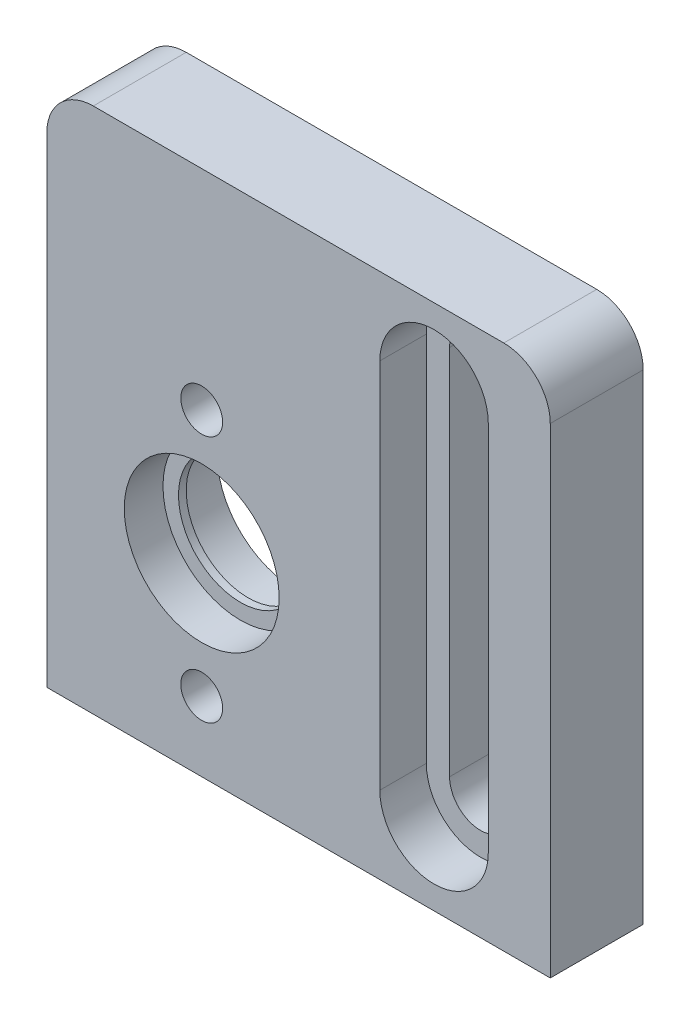
ISO-10303-21;
HEADER;
FILE_DESCRIPTION(('STEP AP214'),'2;1');
FILE_NAME('part.step','',(''),(''),'','','');
FILE_SCHEMA(('AUTOMOTIVE_DESIGN { 1 0 10303 214 1 1 1 1 }'));
ENDSEC;
DATA;
#1=APPLICATION_CONTEXT('core data for automotive mechanical design processes');
#2=APPLICATION_PROTOCOL_DEFINITION('international standard','automotive_design',2000,#1);
#3=PRODUCT_CONTEXT('',#1,'mechanical');
#4=PRODUCT('Part','Part','',(#3));
#5=PRODUCT_RELATED_PRODUCT_CATEGORY('part','',(#4));
#6=PRODUCT_DEFINITION_FORMATION('','',#4);
#7=PRODUCT_DEFINITION_CONTEXT('part definition',#1,'design');
#8=PRODUCT_DEFINITION('design','',#6,#7);
#9=PRODUCT_DEFINITION_SHAPE('','',#8);
#10=(LENGTH_UNIT() NAMED_UNIT(*) SI_UNIT(.MILLI.,.METRE.));
#11=(NAMED_UNIT(*) PLANE_ANGLE_UNIT() SI_UNIT($,.RADIAN.));
#12=(NAMED_UNIT(*) SI_UNIT($,.STERADIAN.) SOLID_ANGLE_UNIT());
#13=UNCERTAINTY_MEASURE_WITH_UNIT(LENGTH_MEASURE(1.E-05),#10,'distance_accuracy_value','');
#14=(GEOMETRIC_REPRESENTATION_CONTEXT(3) GLOBAL_UNCERTAINTY_ASSIGNED_CONTEXT((#13)) GLOBAL_UNIT_ASSIGNED_CONTEXT((#10,
#11,#12)) REPRESENTATION_CONTEXT('',''));
#15=CARTESIAN_POINT('',(0.,0.,0.));
#16=DIRECTION('',(0.,0.,1.));
#17=DIRECTION('',(1.,0.,0.));
#18=AXIS2_PLACEMENT_3D('',#15,#16,#17);
#19=CARTESIAN_POINT('',(0.,0.,9.));
#20=DIRECTION('',(0.,0.,-1.));
#21=DIRECTION('',(1.,0.,0.));
#22=AXIS2_PLACEMENT_3D('',#19,#20,#21);
#23=PLANE('',#22);
#24=CARTESIAN_POINT('',(-22.5,5.,9.));
#25=DIRECTION('',(0.,0.,-1.));
#26=DIRECTION('',(-1.,0.,0.));
#27=AXIS2_PLACEMENT_3D('',#24,#25,#26);
#28=CIRCLE('',#27,1.35);
#29=CARTESIAN_POINT('',(-23.85,5.,9.));
#30=VERTEX_POINT('',#29);
#31=EDGE_CURVE('E454',#30,#30,#28,.T.);
#32=ORIENTED_EDGE('',*,*,#31,.T.);
#33=EDGE_LOOP('',(#32));
#34=FACE_BOUND('',#33,.T.);
#35=CARTESIAN_POINT('',(-22.5,-11.,9.));
#36=DIRECTION('',(0.,0.,-1.));
#37=DIRECTION('',(-1.,0.,0.));
#38=AXIS2_PLACEMENT_3D('',#35,#36,#37);
#39=CIRCLE('',#38,1.35);
#40=CARTESIAN_POINT('',(-23.85,-11.,9.));
#41=VERTEX_POINT('',#40);
#42=EDGE_CURVE('E440',#41,#41,#39,.T.);
#43=ORIENTED_EDGE('',*,*,#42,.T.);
#44=EDGE_LOOP('',(#43));
#45=FACE_BOUND('',#44,.T.);
#46=DIRECTION('',(0.,1.,0.));
#47=VECTOR('',#46,1.);
#48=CARTESIAN_POINT('',(0.,-15.5,9.));
#49=LINE('',#48,#47);
#50=CARTESIAN_POINT('',(0.,-15.5,9.));
#51=VERTEX_POINT('',#50);
#52=CARTESIAN_POINT('',(0.,15.5,9.));
#53=VERTEX_POINT('',#52);
#54=EDGE_CURVE('E196',#51,#53,#49,.T.);
#55=ORIENTED_EDGE('',*,*,#54,.T.);
#56=CARTESIAN_POINT('',(-3.,15.5,9.));
#57=DIRECTION('',(0.,0.,-1.));
#58=DIRECTION('',(-1.,0.,0.));
#59=AXIS2_PLACEMENT_3D('',#56,#57,#58);
#60=CIRCLE('',#59,3.);
#61=CARTESIAN_POINT('',(-3.,18.5,9.));
#62=VERTEX_POINT('',#61);
#63=EDGE_CURVE('E13',#53,#62,#60,.F.);
#64=ORIENTED_EDGE('',*,*,#63,.T.);
#65=DIRECTION('',(1.,0.,0.));
#66=VECTOR('',#65,1.);
#67=CARTESIAN_POINT('',(-32.5,18.5,9.));
#68=LINE('',#67,#66);
#69=CARTESIAN_POINT('',(-29.5,18.5,9.));
#70=VERTEX_POINT('',#69);
#71=EDGE_CURVE('E219',#70,#62,#68,.T.);
#72=ORIENTED_EDGE('',*,*,#71,.F.);
#73=CARTESIAN_POINT('',(-29.5,15.5,9.));
#74=DIRECTION('',(0.,0.,1.));
#75=DIRECTION('',(1.,0.,0.));
#76=AXIS2_PLACEMENT_3D('',#73,#74,#75);
#77=CIRCLE('',#76,3.);
#78=CARTESIAN_POINT('',(-32.5,15.5,9.));
#79=VERTEX_POINT('',#78);
#80=EDGE_CURVE('E245',#79,#70,#77,.F.);
#81=ORIENTED_EDGE('',*,*,#80,.F.);
#82=DIRECTION('',(0.,-1.,0.));
#83=VECTOR('',#82,1.);
#84=CARTESIAN_POINT('',(-32.5,18.5,9.));
#85=LINE('',#84,#83);
#86=CARTESIAN_POINT('',(-32.5,-15.5,9.));
#87=VERTEX_POINT('',#86);
#88=EDGE_CURVE('E217',#79,#87,#85,.T.);
#89=ORIENTED_EDGE('',*,*,#88,.T.);
#90=DIRECTION('',(1.,0.,0.));
#91=VECTOR('',#90,1.);
#92=CARTESIAN_POINT('',(-32.5,-15.5,9.));
#93=LINE('',#92,#91);
#94=EDGE_CURVE('E210',#87,#51,#93,.T.);
#95=ORIENTED_EDGE('',*,*,#94,.T.);
#96=EDGE_LOOP('',(#55,#64,#72,#81,#89,#95));
#97=FACE_BOUND('',#96,.T.);
#98=DIRECTION('',(0.,-1.,0.));
#99=VECTOR('',#98,1.);
#100=CARTESIAN_POINT('',(-4.,13.5,9.));
#101=LINE('',#100,#99);
#102=CARTESIAN_POINT('',(-4.,13.5,9.));
#103=VERTEX_POINT('',#102);
#104=CARTESIAN_POINT('',(-4.,-10.5,9.));
#105=VERTEX_POINT('',#104);
#106=EDGE_CURVE('E408',#103,#105,#101,.T.);
#107=ORIENTED_EDGE('',*,*,#106,.T.);
#108=CARTESIAN_POINT('',(-7.5,-10.5,9.));
#109=DIRECTION('',(0.,0.,-1.));
#110=DIRECTION('',(-1.,0.,0.));
#111=AXIS2_PLACEMENT_3D('',#108,#109,#110);
#112=CIRCLE('',#111,3.5);
#113=CARTESIAN_POINT('',(-11.,-10.5,9.));
#114=VERTEX_POINT('',#113);
#115=EDGE_CURVE('E405',#105,#114,#112,.T.);
#116=ORIENTED_EDGE('',*,*,#115,.T.);
#117=DIRECTION('',(0.,-1.,0.));
#118=VECTOR('',#117,1.);
#119=CARTESIAN_POINT('',(-11.,13.5,9.));
#120=LINE('',#119,#118);
#121=CARTESIAN_POINT('',(-11.,13.5,9.));
#122=VERTEX_POINT('',#121);
#123=EDGE_CURVE('E401',#122,#114,#120,.T.);
#124=ORIENTED_EDGE('',*,*,#123,.F.);
#125=CARTESIAN_POINT('',(-7.5,13.5,9.));
#126=DIRECTION('',(0.,0.,-1.));
#127=DIRECTION('',(-1.,0.,0.));
#128=AXIS2_PLACEMENT_3D('',#125,#126,#127);
#129=CIRCLE('',#128,3.5);
#130=EDGE_CURVE('E411',#122,#103,#129,.T.);
#131=ORIENTED_EDGE('',*,*,#130,.T.);
#132=EDGE_LOOP('',(#107,#116,#124,#131));
#133=FACE_BOUND('',#132,.T.);
#134=CARTESIAN_POINT('',(-22.5,-3.,9.));
#135=DIRECTION('',(0.,0.,-1.));
#136=DIRECTION('',(-1.,0.,0.));
#137=AXIS2_PLACEMENT_3D('',#134,#135,#136);
#138=CIRCLE('',#137,5.);
#139=CARTESIAN_POINT('',(-27.5,-3.,9.));
#140=VERTEX_POINT('',#139);
#141=EDGE_CURVE('E436',#140,#140,#138,.T.);
#142=ORIENTED_EDGE('',*,*,#141,.T.);
#143=EDGE_LOOP('',(#142));
#144=FACE_BOUND('',#143,.T.);
#145=ADVANCED_FACE('F92',(#34,#45,#97,#133,#144),#23,.F.);
#146=CARTESIAN_POINT('',(-7.5,13.5,3.));
#147=DIRECTION('',(0.,0.,1.));
#148=DIRECTION('',(-1.,0.,0.));
#149=AXIS2_PLACEMENT_3D('',#146,#147,#148);
#150=CYLINDRICAL_SURFACE('',#149,2.);
#151=CARTESIAN_POINT('',(-7.5,13.5,6.));
#152=DIRECTION('',(0.,0.,-1.));
#153=DIRECTION('',(-1.,0.,0.));
#154=AXIS2_PLACEMENT_3D('',#151,#152,#153);
#155=CIRCLE('',#154,2.);
#156=CARTESIAN_POINT('',(-5.5,13.5,6.));
#157=VERTEX_POINT('',#156);
#158=CARTESIAN_POINT('',(-9.5,13.5,6.));
#159=VERTEX_POINT('',#158);
#160=EDGE_CURVE('E384',#157,#159,#155,.F.);
#161=ORIENTED_EDGE('',*,*,#160,.T.);
#162=DIRECTION('',(0.,0.,1.));
#163=VECTOR('',#162,1.);
#164=CARTESIAN_POINT('',(-9.5,13.5,3.));
#165=LINE('',#164,#163);
#166=CARTESIAN_POINT('',(-9.5,13.5,3.));
#167=VERTEX_POINT('',#166);
#168=EDGE_CURVE('E360',#167,#159,#165,.T.);
#169=ORIENTED_EDGE('',*,*,#168,.F.);
#170=CARTESIAN_POINT('',(-7.5,13.5,3.));
#171=DIRECTION('',(0.,0.,-1.));
#172=DIRECTION('',(-1.,0.,0.));
#173=AXIS2_PLACEMENT_3D('',#170,#171,#172);
#174=CIRCLE('',#173,2.);
#175=CARTESIAN_POINT('',(-5.5,13.5,3.));
#176=VERTEX_POINT('',#175);
#177=EDGE_CURVE('E381',#167,#176,#174,.T.);
#178=ORIENTED_EDGE('',*,*,#177,.T.);
#179=DIRECTION('',(0.,0.,1.));
#180=VECTOR('',#179,1.);
#181=CARTESIAN_POINT('',(-5.5,13.5,3.));
#182=LINE('',#181,#180);
#183=EDGE_CURVE('E366',#176,#157,#182,.T.);
#184=ORIENTED_EDGE('',*,*,#183,.T.);
#185=EDGE_LOOP('',(#161,#169,#178,#184));
#186=FACE_BOUND('',#185,.T.);
#187=ADVANCED_FACE('F279',(#186),#150,.F.);
#188=CARTESIAN_POINT('',(-9.5,13.5,3.));
#189=DIRECTION('',(1.,0.,0.));
#190=DIRECTION('',(0.,1.,0.));
#191=AXIS2_PLACEMENT_3D('',#188,#189,#190);
#192=PLANE('',#191);
#193=DIRECTION('',(0.,0.,1.));
#194=VECTOR('',#193,1.);
#195=CARTESIAN_POINT('',(-9.5,-10.5,3.));
#196=LINE('',#195,#194);
#197=CARTESIAN_POINT('',(-9.5,-10.5,3.));
#198=VERTEX_POINT('',#197);
#199=CARTESIAN_POINT('',(-9.5,-10.5,6.));
#200=VERTEX_POINT('',#199);
#201=EDGE_CURVE('E363',#198,#200,#196,.T.);
#202=ORIENTED_EDGE('',*,*,#201,.F.);
#203=DIRECTION('',(0.,-1.,0.));
#204=VECTOR('',#203,1.);
#205=CARTESIAN_POINT('',(-9.5,13.5,3.));
#206=LINE('',#205,#204);
#207=EDGE_CURVE('E370',#167,#198,#206,.T.);
#208=ORIENTED_EDGE('',*,*,#207,.F.);
#209=ORIENTED_EDGE('',*,*,#168,.T.);
#210=DIRECTION('',(0.,1.,0.));
#211=VECTOR('',#210,1.);
#212=CARTESIAN_POINT('',(-9.5,13.5,6.));
#213=LINE('',#212,#211);
#214=EDGE_CURVE('E387',#200,#159,#213,.T.);
#215=ORIENTED_EDGE('',*,*,#214,.F.);
#216=EDGE_LOOP('',(#202,#208,#209,#215));
#217=FACE_BOUND('',#216,.T.);
#218=ADVANCED_FACE('F285',(#217),#192,.T.);
#219=CARTESIAN_POINT('',(-7.5,-10.5,3.));
#220=DIRECTION('',(0.,0.,1.));
#221=DIRECTION('',(-1.,0.,0.));
#222=AXIS2_PLACEMENT_3D('',#219,#220,#221);
#223=CYLINDRICAL_SURFACE('',#222,2.);
#224=CARTESIAN_POINT('',(-7.5,-10.5,6.));
#225=DIRECTION('',(0.,0.,-1.));
#226=DIRECTION('',(-1.,0.,0.));
#227=AXIS2_PLACEMENT_3D('',#224,#225,#226);
#228=CIRCLE('',#227,2.);
#229=CARTESIAN_POINT('',(-5.5,-10.5,6.));
#230=VERTEX_POINT('',#229);
#231=EDGE_CURVE('E389',#200,#230,#228,.F.);
#232=ORIENTED_EDGE('',*,*,#231,.T.);
#233=DIRECTION('',(0.,0.,1.));
#234=VECTOR('',#233,1.);
#235=CARTESIAN_POINT('',(-5.5,-10.5,3.));
#236=LINE('',#235,#234);
#237=CARTESIAN_POINT('',(-5.5,-10.5,3.));
#238=VERTEX_POINT('',#237);
#239=EDGE_CURVE('E369',#238,#230,#236,.T.);
#240=ORIENTED_EDGE('',*,*,#239,.F.);
#241=CARTESIAN_POINT('',(-7.5,-10.5,3.));
#242=DIRECTION('',(0.,0.,-1.));
#243=DIRECTION('',(-1.,0.,0.));
#244=AXIS2_PLACEMENT_3D('',#241,#242,#243);
#245=CIRCLE('',#244,2.);
#246=EDGE_CURVE('E377',#238,#198,#245,.T.);
#247=ORIENTED_EDGE('',*,*,#246,.T.);
#248=ORIENTED_EDGE('',*,*,#201,.T.);
#249=EDGE_LOOP('',(#232,#240,#247,#248));
#250=FACE_BOUND('',#249,.T.);
#251=ADVANCED_FACE('F334',(#250),#223,.F.);
#252=CARTESIAN_POINT('',(-5.5,13.5,3.));
#253=DIRECTION('',(1.,0.,0.));
#254=DIRECTION('',(0.,1.,0.));
#255=AXIS2_PLACEMENT_3D('',#252,#253,#254);
#256=PLANE('',#255);
#257=DIRECTION('',(0.,1.,0.));
#258=VECTOR('',#257,1.);
#259=CARTESIAN_POINT('',(-5.5,13.5,6.));
#260=LINE('',#259,#258);
#261=EDGE_CURVE('E235',#230,#157,#260,.T.);
#262=ORIENTED_EDGE('',*,*,#261,.T.);
#263=ORIENTED_EDGE('',*,*,#183,.F.);
#264=DIRECTION('',(0.,-1.,0.));
#265=VECTOR('',#264,1.);
#266=CARTESIAN_POINT('',(-5.5,13.5,3.));
#267=LINE('',#266,#265);
#268=EDGE_CURVE('E379',#176,#238,#267,.T.);
#269=ORIENTED_EDGE('',*,*,#268,.T.);
#270=ORIENTED_EDGE('',*,*,#239,.T.);
#271=EDGE_LOOP('',(#262,#263,#269,#270));
#272=FACE_BOUND('',#271,.T.);
#273=ADVANCED_FACE('F338',(#272),#256,.F.);
#274=CARTESIAN_POINT('',(-22.5,-3.,9.));
#275=DIRECTION('',(0.,0.,-1.));
#276=DIRECTION('',(1.,0.,0.));
#277=AXIS2_PLACEMENT_3D('',#274,#275,#276);
#278=CYLINDRICAL_SURFACE('',#277,3.99999999999999);
#279=CARTESIAN_POINT('',(-22.5,-3.,6.5));
#280=DIRECTION('',(0.,0.,-1.));
#281=DIRECTION('',(-1.,0.,0.));
#282=AXIS2_PLACEMENT_3D('',#279,#280,#281);
#283=CIRCLE('',#282,3.99999999999999);
#284=CARTESIAN_POINT('',(-26.5,-3.,6.5));
#285=VERTEX_POINT('',#284);
#286=EDGE_CURVE('E96',#285,#285,#283,.F.);
#287=ORIENTED_EDGE('',*,*,#286,.T.);
#288=EDGE_LOOP('',(#287));
#289=FACE_BOUND('',#288,.T.);
#290=CARTESIAN_POINT('',(-22.5,-3.,6.));
#291=DIRECTION('',(0.,0.,1.));
#292=DIRECTION('',(1.,0.,0.));
#293=AXIS2_PLACEMENT_3D('',#290,#291,#292);
#294=CIRCLE('',#293,3.99999999999999);
#295=CARTESIAN_POINT('',(-18.5,-3.,6.));
#296=VERTEX_POINT('',#295);
#297=EDGE_CURVE('E231',#296,#296,#294,.F.);
#298=ORIENTED_EDGE('',*,*,#297,.T.);
#299=EDGE_LOOP('',(#298));
#300=FACE_BOUND('',#299,.T.);
#301=ADVANCED_FACE('F292',(#289,#300),#278,.F.);
#302=CARTESIAN_POINT('',(-32.5,18.5,9.));
#303=DIRECTION('',(-1.,0.,0.));
#304=DIRECTION('',(0.,0.,-1.));
#305=AXIS2_PLACEMENT_3D('',#302,#303,#304);
#306=PLANE('',#305);
#307=DIRECTION('',(0.,-1.,0.));
#308=VECTOR('',#307,1.);
#309=CARTESIAN_POINT('',(-32.5,18.5,3.));
#310=LINE('',#309,#308);
#311=CARTESIAN_POINT('',(-32.5,15.5,3.));
#312=VERTEX_POINT('',#311);
#313=CARTESIAN_POINT('',(-32.5,-15.5,3.));
#314=VERTEX_POINT('',#313);
#315=EDGE_CURVE('E228',#312,#314,#310,.T.);
#316=ORIENTED_EDGE('',*,*,#315,.T.);
#317=DIRECTION('',(0.,0.,-1.));
#318=VECTOR('',#317,1.);
#319=CARTESIAN_POINT('',(-32.5,-15.5,9.));
#320=LINE('',#319,#318);
#321=EDGE_CURVE('E222',#87,#314,#320,.T.);
#322=ORIENTED_EDGE('',*,*,#321,.F.);
#323=ORIENTED_EDGE('',*,*,#88,.F.);
#324=DIRECTION('',(0.,0.,-1.));
#325=VECTOR('',#324,1.);
#326=CARTESIAN_POINT('',(-32.5,15.5,9.));
#327=LINE('',#326,#325);
#328=EDGE_CURVE('E247',#312,#79,#327,.F.);
#329=ORIENTED_EDGE('',*,*,#328,.F.);
#330=EDGE_LOOP('',(#316,#322,#323,#329));
#331=FACE_BOUND('',#330,.T.);
#332=ADVANCED_FACE('F300',(#331),#306,.T.);
#333=CARTESIAN_POINT('',(-32.5,18.5,9.));
#334=DIRECTION('',(0.,-1.,0.));
#335=DIRECTION('',(0.,0.,1.));
#336=AXIS2_PLACEMENT_3D('',#333,#334,#335);
#337=PLANE('',#336);
#338=ORIENTED_EDGE('',*,*,#71,.T.);
#339=DIRECTION('',(0.,0.,-1.));
#340=VECTOR('',#339,1.);
#341=CARTESIAN_POINT('',(-3.,18.5,9.));
#342=LINE('',#341,#340);
#343=CARTESIAN_POINT('',(-3.,18.5,3.));
#344=VERTEX_POINT('',#343);
#345=EDGE_CURVE('E250',#62,#344,#342,.T.);
#346=ORIENTED_EDGE('',*,*,#345,.T.);
#347=DIRECTION('',(1.,0.,0.));
#348=VECTOR('',#347,1.);
#349=CARTESIAN_POINT('',(-32.5,18.5,3.));
#350=LINE('',#349,#348);
#351=CARTESIAN_POINT('',(-29.5,18.5,3.));
#352=VERTEX_POINT('',#351);
#353=EDGE_CURVE('E224',#352,#344,#350,.T.);
#354=ORIENTED_EDGE('',*,*,#353,.F.);
#355=DIRECTION('',(0.,0.,-1.));
#356=VECTOR('',#355,1.);
#357=CARTESIAN_POINT('',(-29.5,18.5,3.));
#358=LINE('',#357,#356);
#359=EDGE_CURVE('E242',#70,#352,#358,.T.);
#360=ORIENTED_EDGE('',*,*,#359,.F.);
#361=EDGE_LOOP('',(#338,#346,#354,#360));
#362=FACE_BOUND('',#361,.T.);
#363=ADVANCED_FACE('F257',(#362),#337,.F.);
#364=CARTESIAN_POINT('',(-32.5,-15.5,9.));
#365=DIRECTION('',(0.,-1.,0.));
#366=DIRECTION('',(0.,0.,1.));
#367=AXIS2_PLACEMENT_3D('',#364,#365,#366);
#368=PLANE('',#367);
#369=DIRECTION('',(0.,0.,-1.));
#370=VECTOR('',#369,1.);
#371=CARTESIAN_POINT('',(0.,-15.5,9.));
#372=LINE('',#371,#370);
#373=CARTESIAN_POINT('',(0.,-15.5,3.));
#374=VERTEX_POINT('',#373);
#375=EDGE_CURVE('E199',#51,#374,#372,.T.);
#376=ORIENTED_EDGE('',*,*,#375,.F.);
#377=ORIENTED_EDGE('',*,*,#94,.F.);
#378=ORIENTED_EDGE('',*,*,#321,.T.);
#379=DIRECTION('',(1.,0.,0.));
#380=VECTOR('',#379,1.);
#381=CARTESIAN_POINT('',(-32.5,-15.5,3.));
#382=LINE('',#381,#380);
#383=EDGE_CURVE('E212',#314,#374,#382,.T.);
#384=ORIENTED_EDGE('',*,*,#383,.T.);
#385=EDGE_LOOP('',(#376,#377,#378,#384));
#386=FACE_BOUND('',#385,.T.);
#387=CARTESIAN_POINT('',(-28.5,-15.5,5.5));
#388=DIRECTION('',(0.,1.,0.));
#389=DIRECTION('',(0.,0.,1.));
#390=AXIS2_PLACEMENT_3D('',#387,#388,#389);
#391=CIRCLE('',#390,1.25);
#392=CARTESIAN_POINT('',(-28.5,-15.5,6.75));
#393=VERTEX_POINT('',#392);
#394=EDGE_CURVE('E213',#393,#393,#391,.T.);
#395=ORIENTED_EDGE('',*,*,#394,.T.);
#396=EDGE_LOOP('',(#395));
#397=FACE_BOUND('',#396,.T.);
#398=CARTESIAN_POINT('',(-16.5,-15.5,5.5));
#399=DIRECTION('',(0.,1.,0.));
#400=DIRECTION('',(0.,0.,1.));
#401=AXIS2_PLACEMENT_3D('',#398,#399,#400);
#402=CIRCLE('',#401,1.25);
#403=CARTESIAN_POINT('',(-16.5,-15.5,6.75));
#404=VERTEX_POINT('',#403);
#405=EDGE_CURVE('E427',#404,#404,#402,.T.);
#406=ORIENTED_EDGE('',*,*,#405,.T.);
#407=EDGE_LOOP('',(#406));
#408=FACE_BOUND('',#407,.T.);
#409=ADVANCED_FACE('F207',(#386,#397,#408),#368,.T.);
#410=CARTESIAN_POINT('',(0.,0.,3.));
#411=DIRECTION('',(0.,0.,-1.));
#412=DIRECTION('',(1.,0.,0.));
#413=AXIS2_PLACEMENT_3D('',#410,#411,#412);
#414=PLANE('',#413);
#415=CARTESIAN_POINT('',(-22.5,5.,3.));
#416=DIRECTION('',(0.,0.,-1.));
#417=DIRECTION('',(-1.,0.,0.));
#418=AXIS2_PLACEMENT_3D('',#415,#416,#417);
#419=CIRCLE('',#418,2.75);
#420=CARTESIAN_POINT('',(-25.25,5.,3.));
#421=VERTEX_POINT('',#420);
#422=EDGE_CURVE('E462',#421,#421,#419,.T.);
#423=ORIENTED_EDGE('',*,*,#422,.F.);
#424=EDGE_LOOP('',(#423));
#425=FACE_BOUND('',#424,.T.);
#426=CARTESIAN_POINT('',(-22.5,-11.,3.));
#427=DIRECTION('',(0.,0.,-1.));
#428=DIRECTION('',(-1.,0.,0.));
#429=AXIS2_PLACEMENT_3D('',#426,#427,#428);
#430=CIRCLE('',#429,2.75);
#431=CARTESIAN_POINT('',(-25.25,-11.,3.));
#432=VERTEX_POINT('',#431);
#433=EDGE_CURVE('E451',#432,#432,#430,.T.);
#434=ORIENTED_EDGE('',*,*,#433,.F.);
#435=EDGE_LOOP('',(#434));
#436=FACE_BOUND('',#435,.T.);
#437=ORIENTED_EDGE('',*,*,#353,.T.);
#438=CARTESIAN_POINT('',(-3.,15.5,3.));
#439=DIRECTION('',(0.,0.,-1.));
#440=DIRECTION('',(-1.,0.,0.));
#441=AXIS2_PLACEMENT_3D('',#438,#439,#440);
#442=CIRCLE('',#441,3.);
#443=CARTESIAN_POINT('',(0.,15.5,3.));
#444=VERTEX_POINT('',#443);
#445=EDGE_CURVE('E115',#344,#444,#442,.T.);
#446=ORIENTED_EDGE('',*,*,#445,.T.);
#447=DIRECTION('',(0.,1.,0.));
#448=VECTOR('',#447,1.);
#449=CARTESIAN_POINT('',(0.,-15.5,3.));
#450=LINE('',#449,#448);
#451=EDGE_CURVE('E203',#374,#444,#450,.T.);
#452=ORIENTED_EDGE('',*,*,#451,.F.);
#453=ORIENTED_EDGE('',*,*,#383,.F.);
#454=ORIENTED_EDGE('',*,*,#315,.F.);
#455=CARTESIAN_POINT('',(-29.5,15.5,3.));
#456=DIRECTION('',(0.,0.,1.));
#457=DIRECTION('',(1.,0.,0.));
#458=AXIS2_PLACEMENT_3D('',#455,#456,#457);
#459=CIRCLE('',#458,3.);
#460=EDGE_CURVE('E240',#352,#312,#459,.T.);
#461=ORIENTED_EDGE('',*,*,#460,.F.);
#462=EDGE_LOOP('',(#437,#446,#452,#453,#454,#461));
#463=FACE_BOUND('',#462,.T.);
#464=ORIENTED_EDGE('',*,*,#177,.F.);
#465=ORIENTED_EDGE('',*,*,#207,.T.);
#466=ORIENTED_EDGE('',*,*,#246,.F.);
#467=ORIENTED_EDGE('',*,*,#268,.F.);
#468=EDGE_LOOP('',(#464,#465,#466,#467));
#469=FACE_BOUND('',#468,.T.);
#470=CARTESIAN_POINT('',(-22.5,-3.,3.));
#471=DIRECTION('',(0.,0.,1.));
#472=DIRECTION('',(1.,0.,0.));
#473=AXIS2_PLACEMENT_3D('',#470,#471,#472);
#474=CIRCLE('',#473,5.);
#475=CARTESIAN_POINT('',(-17.5,-3.,3.));
#476=VERTEX_POINT('',#475);
#477=EDGE_CURVE('E358',#476,#476,#474,.T.);
#478=ORIENTED_EDGE('',*,*,#477,.T.);
#479=EDGE_LOOP('',(#478));
#480=FACE_BOUND('',#479,.T.);
#481=ADVANCED_FACE('F261',(#425,#436,#463,#469,#480),#414,.T.);
#482=CARTESIAN_POINT('',(-22.5,-3.,6.));
#483=DIRECTION('',(0.,0.,-1.));
#484=DIRECTION('',(1.,0.,0.));
#485=AXIS2_PLACEMENT_3D('',#482,#483,#484);
#486=PLANE('',#485);
#487=CARTESIAN_POINT('',(-22.5,-3.,6.));
#488=DIRECTION('',(0.,0.,1.));
#489=DIRECTION('',(1.,0.,0.));
#490=AXIS2_PLACEMENT_3D('',#487,#488,#489);
#491=CIRCLE('',#490,5.);
#492=CARTESIAN_POINT('',(-17.5,-3.,6.));
#493=VERTEX_POINT('',#492);
#494=EDGE_CURVE('E238',#493,#493,#491,.T.);
#495=ORIENTED_EDGE('',*,*,#494,.F.);
#496=EDGE_LOOP('',(#495));
#497=FACE_BOUND('',#496,.T.);
#498=ORIENTED_EDGE('',*,*,#297,.F.);
#499=EDGE_LOOP('',(#498));
#500=FACE_BOUND('',#499,.T.);
#501=ADVANCED_FACE('F296',(#497,#500),#486,.T.);
#502=CARTESIAN_POINT('',(-22.5,-3.,6.));
#503=DIRECTION('',(0.,0.,-1.));
#504=DIRECTION('',(1.,0.,0.));
#505=AXIS2_PLACEMENT_3D('',#502,#503,#504);
#506=CYLINDRICAL_SURFACE('',#505,5.);
#507=ORIENTED_EDGE('',*,*,#494,.T.);
#508=EDGE_LOOP('',(#507));
#509=FACE_BOUND('',#508,.T.);
#510=ORIENTED_EDGE('',*,*,#477,.F.);
#511=EDGE_LOOP('',(#510));
#512=FACE_BOUND('',#511,.T.);
#513=ADVANCED_FACE('F344',(#509,#512),#506,.F.);
#514=CARTESIAN_POINT('',(-7.5,13.5,6.));
#515=DIRECTION('',(0.,0.,1.));
#516=DIRECTION('',(-1.,0.,0.));
#517=AXIS2_PLACEMENT_3D('',#514,#515,#516);
#518=PLANE('',#517);
#519=CARTESIAN_POINT('',(-7.5,13.5,6.));
#520=DIRECTION('',(0.,0.,-1.));
#521=DIRECTION('',(-1.,0.,0.));
#522=AXIS2_PLACEMENT_3D('',#519,#520,#521);
#523=CIRCLE('',#522,3.5);
#524=CARTESIAN_POINT('',(-11.,13.5,6.));
#525=VERTEX_POINT('',#524);
#526=CARTESIAN_POINT('',(-4.,13.5,6.));
#527=VERTEX_POINT('',#526);
#528=EDGE_CURVE('E404',#525,#527,#523,.T.);
#529=ORIENTED_EDGE('',*,*,#528,.F.);
#530=DIRECTION('',(0.,-1.,0.));
#531=VECTOR('',#530,1.);
#532=CARTESIAN_POINT('',(-11.,13.5,6.));
#533=LINE('',#532,#531);
#534=CARTESIAN_POINT('',(-11.,-10.5,6.));
#535=VERTEX_POINT('',#534);
#536=EDGE_CURVE('E396',#525,#535,#533,.T.);
#537=ORIENTED_EDGE('',*,*,#536,.T.);
#538=CARTESIAN_POINT('',(-7.5,-10.5,6.));
#539=DIRECTION('',(0.,0.,-1.));
#540=DIRECTION('',(-1.,0.,0.));
#541=AXIS2_PLACEMENT_3D('',#538,#539,#540);
#542=CIRCLE('',#541,3.5);
#543=CARTESIAN_POINT('',(-4.,-10.5,6.));
#544=VERTEX_POINT('',#543);
#545=EDGE_CURVE('E417',#544,#535,#542,.T.);
#546=ORIENTED_EDGE('',*,*,#545,.F.);
#547=DIRECTION('',(0.,-1.,0.));
#548=VECTOR('',#547,1.);
#549=CARTESIAN_POINT('',(-4.,13.5,6.));
#550=LINE('',#549,#548);
#551=EDGE_CURVE('E420',#527,#544,#550,.T.);
#552=ORIENTED_EDGE('',*,*,#551,.F.);
#553=EDGE_LOOP('',(#529,#537,#546,#552));
#554=FACE_BOUND('',#553,.T.);
#555=ORIENTED_EDGE('',*,*,#160,.F.);
#556=ORIENTED_EDGE('',*,*,#261,.F.);
#557=ORIENTED_EDGE('',*,*,#231,.F.);
#558=ORIENTED_EDGE('',*,*,#214,.T.);
#559=EDGE_LOOP('',(#555,#556,#557,#558));
#560=FACE_BOUND('',#559,.T.);
#561=ADVANCED_FACE('F330',(#554,#560),#518,.T.);
#562=CARTESIAN_POINT('',(-7.5,13.5,6.));
#563=DIRECTION('',(0.,0.,1.));
#564=DIRECTION('',(-1.,0.,0.));
#565=AXIS2_PLACEMENT_3D('',#562,#563,#564);
#566=CYLINDRICAL_SURFACE('',#565,3.5);
#567=ORIENTED_EDGE('',*,*,#130,.F.);
#568=DIRECTION('',(0.,0.,1.));
#569=VECTOR('',#568,1.);
#570=CARTESIAN_POINT('',(-11.,13.5,6.));
#571=LINE('',#570,#569);
#572=EDGE_CURVE('E392',#525,#122,#571,.T.);
#573=ORIENTED_EDGE('',*,*,#572,.F.);
#574=ORIENTED_EDGE('',*,*,#528,.T.);
#575=DIRECTION('',(0.,0.,1.));
#576=VECTOR('',#575,1.);
#577=CARTESIAN_POINT('',(-4.,13.5,6.));
#578=LINE('',#577,#576);
#579=EDGE_CURVE('E393',#527,#103,#578,.T.);
#580=ORIENTED_EDGE('',*,*,#579,.T.);
#581=EDGE_LOOP('',(#567,#573,#574,#580));
#582=FACE_BOUND('',#581,.T.);
#583=ADVANCED_FACE('F327',(#582),#566,.F.);
#584=CARTESIAN_POINT('',(-11.,13.5,6.));
#585=DIRECTION('',(1.,0.,0.));
#586=DIRECTION('',(0.,1.,0.));
#587=AXIS2_PLACEMENT_3D('',#584,#585,#586);
#588=PLANE('',#587);
#589=ORIENTED_EDGE('',*,*,#123,.T.);
#590=DIRECTION('',(0.,0.,1.));
#591=VECTOR('',#590,1.);
#592=CARTESIAN_POINT('',(-11.,-10.5,6.));
#593=LINE('',#592,#591);
#594=EDGE_CURVE('E398',#535,#114,#593,.T.);
#595=ORIENTED_EDGE('',*,*,#594,.F.);
#596=ORIENTED_EDGE('',*,*,#536,.F.);
#597=ORIENTED_EDGE('',*,*,#572,.T.);
#598=EDGE_LOOP('',(#589,#595,#596,#597));
#599=FACE_BOUND('',#598,.T.);
#600=ADVANCED_FACE('F321',(#599),#588,.T.);
#601=CARTESIAN_POINT('',(-7.5,-10.5,6.));
#602=DIRECTION('',(0.,0.,1.));
#603=DIRECTION('',(-1.,0.,0.));
#604=AXIS2_PLACEMENT_3D('',#601,#602,#603);
#605=CYLINDRICAL_SURFACE('',#604,3.5);
#606=ORIENTED_EDGE('',*,*,#115,.F.);
#607=DIRECTION('',(0.,0.,1.));
#608=VECTOR('',#607,1.);
#609=CARTESIAN_POINT('',(-4.,-10.5,6.));
#610=LINE('',#609,#608);
#611=EDGE_CURVE('E395',#544,#105,#610,.T.);
#612=ORIENTED_EDGE('',*,*,#611,.F.);
#613=ORIENTED_EDGE('',*,*,#545,.T.);
#614=ORIENTED_EDGE('',*,*,#594,.T.);
#615=EDGE_LOOP('',(#606,#612,#613,#614));
#616=FACE_BOUND('',#615,.T.);
#617=ADVANCED_FACE('F315',(#616),#605,.F.);
#618=CARTESIAN_POINT('',(-4.,13.5,6.));
#619=DIRECTION('',(1.,0.,0.));
#620=DIRECTION('',(0.,1.,0.));
#621=AXIS2_PLACEMENT_3D('',#618,#619,#620);
#622=PLANE('',#621);
#623=ORIENTED_EDGE('',*,*,#106,.F.);
#624=ORIENTED_EDGE('',*,*,#579,.F.);
#625=ORIENTED_EDGE('',*,*,#551,.T.);
#626=ORIENTED_EDGE('',*,*,#611,.T.);
#627=EDGE_LOOP('',(#623,#624,#625,#626));
#628=FACE_BOUND('',#627,.T.);
#629=ADVANCED_FACE('F307',(#628),#622,.F.);
#630=CARTESIAN_POINT('',(-29.5,15.5,9.));
#631=DIRECTION('',(0.,0.,1.));
#632=DIRECTION('',(-1.,0.,0.));
#633=AXIS2_PLACEMENT_3D('',#630,#631,#632);
#634=CYLINDRICAL_SURFACE('',#633,3.);
#635=ORIENTED_EDGE('',*,*,#80,.T.);
#636=ORIENTED_EDGE('',*,*,#359,.T.);
#637=ORIENTED_EDGE('',*,*,#460,.T.);
#638=ORIENTED_EDGE('',*,*,#328,.T.);
#639=EDGE_LOOP('',(#635,#636,#637,#638));
#640=FACE_BOUND('',#639,.T.);
#641=ADVANCED_FACE('F266',(#640),#634,.T.);
#642=CARTESIAN_POINT('',(-16.5,-8.5,5.5));
#643=DIRECTION('',(0.,-1.,0.));
#644=DIRECTION('',(0.,0.,1.));
#645=AXIS2_PLACEMENT_3D('',#642,#643,#644);
#646=CONICAL_SURFACE('',#645,1.25,1.02974425867665);
#647=CARTESIAN_POINT('',(-16.5,-7.74892422621555,5.5));
#648=VERTEX_POINT('',#647);
#649=VERTEX_LOOP('',#648);
#650=FACE_BOUND('',#649,.T.);
#651=CARTESIAN_POINT('',(-16.5,-8.5,5.5));
#652=DIRECTION('',(0.,1.,0.));
#653=DIRECTION('',(0.,0.,1.));
#654=AXIS2_PLACEMENT_3D('',#651,#652,#653);
#655=CIRCLE('',#654,1.25);
#656=CARTESIAN_POINT('',(-16.5,-8.5,6.75));
#657=VERTEX_POINT('',#656);
#658=EDGE_CURVE('E414',#657,#657,#655,.T.);
#659=ORIENTED_EDGE('',*,*,#658,.F.);
#660=EDGE_LOOP('',(#659));
#661=FACE_BOUND('',#660,.T.);
#662=ADVANCED_FACE('F306',(#650,#661),#646,.F.);
#663=CARTESIAN_POINT('',(-16.5,-15.5,5.5));
#664=DIRECTION('',(0.,-1.,0.));
#665=DIRECTION('',(0.,0.,1.));
#666=AXIS2_PLACEMENT_3D('',#663,#664,#665);
#667=CYLINDRICAL_SURFACE('',#666,1.25);
#668=ORIENTED_EDGE('',*,*,#658,.T.);
#669=EDGE_LOOP('',(#668));
#670=FACE_BOUND('',#669,.T.);
#671=ORIENTED_EDGE('',*,*,#405,.F.);
#672=EDGE_LOOP('',(#671));
#673=FACE_BOUND('',#672,.T.);
#674=ADVANCED_FACE('F312',(#670,#673),#667,.F.);
#675=CARTESIAN_POINT('',(-28.5,-8.5,5.5));
#676=DIRECTION('',(0.,-1.,0.));
#677=DIRECTION('',(0.,0.,1.));
#678=AXIS2_PLACEMENT_3D('',#675,#676,#677);
#679=CONICAL_SURFACE('',#678,1.25,1.02974425867665);
#680=CARTESIAN_POINT('',(-28.5,-7.74892422621555,5.5));
#681=VERTEX_POINT('',#680);
#682=VERTEX_LOOP('',#681);
#683=FACE_BOUND('',#682,.T.);
#684=CARTESIAN_POINT('',(-28.5,-8.5,5.5));
#685=DIRECTION('',(0.,1.,0.));
#686=DIRECTION('',(0.,0.,1.));
#687=AXIS2_PLACEMENT_3D('',#684,#685,#686);
#688=CIRCLE('',#687,1.25);
#689=CARTESIAN_POINT('',(-28.5,-8.5,6.75));
#690=VERTEX_POINT('',#689);
#691=EDGE_CURVE('E430',#690,#690,#688,.T.);
#692=ORIENTED_EDGE('',*,*,#691,.F.);
#693=EDGE_LOOP('',(#692));
#694=FACE_BOUND('',#693,.T.);
#695=ADVANCED_FACE('F497',(#683,#694),#679,.F.);
#696=CARTESIAN_POINT('',(-28.5,-15.5,5.5));
#697=DIRECTION('',(0.,-1.,0.));
#698=DIRECTION('',(0.,0.,1.));
#699=AXIS2_PLACEMENT_3D('',#696,#697,#698);
#700=CYLINDRICAL_SURFACE('',#699,1.25);
#701=ORIENTED_EDGE('',*,*,#691,.T.);
#702=EDGE_LOOP('',(#701));
#703=FACE_BOUND('',#702,.T.);
#704=ORIENTED_EDGE('',*,*,#394,.F.);
#705=EDGE_LOOP('',(#704));
#706=FACE_BOUND('',#705,.T.);
#707=ADVANCED_FACE('F276',(#703,#706),#700,.F.);
#708=CARTESIAN_POINT('',(0.,-15.5,9.));
#709=DIRECTION('',(-1.,0.,0.));
#710=DIRECTION('',(0.,0.,1.));
#711=AXIS2_PLACEMENT_3D('',#708,#709,#710);
#712=PLANE('',#711);
#713=ORIENTED_EDGE('',*,*,#451,.T.);
#714=DIRECTION('',(0.,0.,-1.));
#715=VECTOR('',#714,1.);
#716=CARTESIAN_POINT('',(0.,15.5,9.));
#717=LINE('',#716,#715);
#718=EDGE_CURVE('E101',#444,#53,#717,.F.);
#719=ORIENTED_EDGE('',*,*,#718,.T.);
#720=ORIENTED_EDGE('',*,*,#54,.F.);
#721=ORIENTED_EDGE('',*,*,#375,.T.);
#722=EDGE_LOOP('',(#713,#719,#720,#721));
#723=FACE_BOUND('',#722,.T.);
#724=ADVANCED_FACE('F198',(#723),#712,.F.);
#725=CARTESIAN_POINT('',(-3.,15.5,9.));
#726=DIRECTION('',(0.,0.,-1.));
#727=DIRECTION('',(-1.,0.,0.));
#728=AXIS2_PLACEMENT_3D('',#725,#726,#727);
#729=CYLINDRICAL_SURFACE('',#728,3.);
#730=ORIENTED_EDGE('',*,*,#63,.F.);
#731=ORIENTED_EDGE('',*,*,#718,.F.);
#732=ORIENTED_EDGE('',*,*,#445,.F.);
#733=ORIENTED_EDGE('',*,*,#345,.F.);
#734=EDGE_LOOP('',(#730,#731,#732,#733));
#735=FACE_BOUND('',#734,.T.);
#736=ADVANCED_FACE('F94',(#735),#729,.T.);
#737=CARTESIAN_POINT('',(-22.5,-3.,6.5));
#738=DIRECTION('',(0.,0.,-1.));
#739=DIRECTION('',(-1.,0.,0.));
#740=AXIS2_PLACEMENT_3D('',#737,#738,#739);
#741=PLANE('',#740);
#742=CARTESIAN_POINT('',(-22.5,-3.,6.5));
#743=DIRECTION('',(0.,0.,-1.));
#744=DIRECTION('',(-1.,0.,0.));
#745=AXIS2_PLACEMENT_3D('',#742,#743,#744);
#746=CIRCLE('',#745,5.);
#747=CARTESIAN_POINT('',(-27.5,-3.,6.5));
#748=VERTEX_POINT('',#747);
#749=EDGE_CURVE('E439',#748,#748,#746,.T.);
#750=ORIENTED_EDGE('',*,*,#749,.F.);
#751=EDGE_LOOP('',(#750));
#752=FACE_BOUND('',#751,.T.);
#753=ORIENTED_EDGE('',*,*,#286,.F.);
#754=EDGE_LOOP('',(#753));
#755=FACE_BOUND('',#754,.T.);
#756=ADVANCED_FACE('F268',(#752,#755),#741,.F.);
#757=CARTESIAN_POINT('',(-22.5,-3.,6.5));
#758=DIRECTION('',(0.,0.,1.));
#759=DIRECTION('',(1.,0.,0.));
#760=AXIS2_PLACEMENT_3D('',#757,#758,#759);
#761=CYLINDRICAL_SURFACE('',#760,5.);
#762=ORIENTED_EDGE('',*,*,#749,.T.);
#763=EDGE_LOOP('',(#762));
#764=FACE_BOUND('',#763,.T.);
#765=ORIENTED_EDGE('',*,*,#141,.F.);
#766=EDGE_LOOP('',(#765));
#767=FACE_BOUND('',#766,.T.);
#768=ADVANCED_FACE('F273',(#764,#767),#761,.F.);
#769=CARTESIAN_POINT('',(-22.5,-11.,3.));
#770=DIRECTION('',(0.,0.,-1.));
#771=DIRECTION('',(-1.,0.,0.));
#772=AXIS2_PLACEMENT_3D('',#769,#770,#771);
#773=CYLINDRICAL_SURFACE('',#772,1.35);
#774=ORIENTED_EDGE('',*,*,#42,.F.);
#775=EDGE_LOOP('',(#774));
#776=FACE_BOUND('',#775,.T.);
#777=CARTESIAN_POINT('',(-22.5,-11.,4.8));
#778=DIRECTION('',(0.,0.,-1.));
#779=DIRECTION('',(-1.,0.,0.));
#780=AXIS2_PLACEMENT_3D('',#777,#778,#779);
#781=CIRCLE('',#780,1.35);
#782=CARTESIAN_POINT('',(-23.85,-11.,4.8));
#783=VERTEX_POINT('',#782);
#784=EDGE_CURVE('E445',#783,#783,#781,.T.);
#785=ORIENTED_EDGE('',*,*,#784,.T.);
#786=EDGE_LOOP('',(#785));
#787=FACE_BOUND('',#786,.T.);
#788=ADVANCED_FACE('F483',(#776,#787),#773,.F.);
#789=CARTESIAN_POINT('',(-21.15,-11.,4.8));
#790=DIRECTION('',(0.,0.,1.));
#791=DIRECTION('',(1.,0.,0.));
#792=AXIS2_PLACEMENT_3D('',#789,#790,#791);
#793=PLANE('',#792);
#794=ORIENTED_EDGE('',*,*,#784,.F.);
#795=EDGE_LOOP('',(#794));
#796=FACE_BOUND('',#795,.T.);
#797=CARTESIAN_POINT('',(-22.5,-11.,4.8));
#798=DIRECTION('',(0.,0.,-1.));
#799=DIRECTION('',(-1.,0.,0.));
#800=AXIS2_PLACEMENT_3D('',#797,#798,#799);
#801=CIRCLE('',#800,2.75);
#802=CARTESIAN_POINT('',(-25.25,-11.,4.8));
#803=VERTEX_POINT('',#802);
#804=EDGE_CURVE('E448',#803,#803,#801,.T.);
#805=ORIENTED_EDGE('',*,*,#804,.T.);
#806=EDGE_LOOP('',(#805));
#807=FACE_BOUND('',#806,.T.);
#808=ADVANCED_FACE('F473',(#796,#807),#793,.F.);
#809=CARTESIAN_POINT('',(-22.5,-11.,3.));
#810=DIRECTION('',(0.,0.,-1.));
#811=DIRECTION('',(-1.,0.,0.));
#812=AXIS2_PLACEMENT_3D('',#809,#810,#811);
#813=CYLINDRICAL_SURFACE('',#812,2.75);
#814=ORIENTED_EDGE('',*,*,#804,.F.);
#815=EDGE_LOOP('',(#814));
#816=FACE_BOUND('',#815,.T.);
#817=ORIENTED_EDGE('',*,*,#433,.T.);
#818=EDGE_LOOP('',(#817));
#819=FACE_BOUND('',#818,.T.);
#820=ADVANCED_FACE('F470',(#816,#819),#813,.F.);
#821=CARTESIAN_POINT('',(-22.5,5.,3.));
#822=DIRECTION('',(0.,0.,-1.));
#823=DIRECTION('',(-1.,0.,0.));
#824=AXIS2_PLACEMENT_3D('',#821,#822,#823);
#825=CYLINDRICAL_SURFACE('',#824,1.35);
#826=ORIENTED_EDGE('',*,*,#31,.F.);
#827=EDGE_LOOP('',(#826));
#828=FACE_BOUND('',#827,.T.);
#829=CARTESIAN_POINT('',(-22.5,5.,4.8));
#830=DIRECTION('',(0.,0.,-1.));
#831=DIRECTION('',(-1.,0.,0.));
#832=AXIS2_PLACEMENT_3D('',#829,#830,#831);
#833=CIRCLE('',#832,1.35);
#834=CARTESIAN_POINT('',(-23.85,5.,4.8));
#835=VERTEX_POINT('',#834);
#836=EDGE_CURVE('E456',#835,#835,#833,.T.);
#837=ORIENTED_EDGE('',*,*,#836,.T.);
#838=EDGE_LOOP('',(#837));
#839=FACE_BOUND('',#838,.T.);
#840=ADVANCED_FACE('F472',(#828,#839),#825,.F.);
#841=CARTESIAN_POINT('',(-21.15,5.,4.8));
#842=DIRECTION('',(0.,0.,1.));
#843=DIRECTION('',(1.,0.,0.));
#844=AXIS2_PLACEMENT_3D('',#841,#842,#843);
#845=PLANE('',#844);
#846=ORIENTED_EDGE('',*,*,#836,.F.);
#847=EDGE_LOOP('',(#846));
#848=FACE_BOUND('',#847,.T.);
#849=CARTESIAN_POINT('',(-22.5,5.,4.8));
#850=DIRECTION('',(0.,0.,-1.));
#851=DIRECTION('',(-1.,0.,0.));
#852=AXIS2_PLACEMENT_3D('',#849,#850,#851);
#853=CIRCLE('',#852,2.75);
#854=CARTESIAN_POINT('',(-25.25,5.,4.8));
#855=VERTEX_POINT('',#854);
#856=EDGE_CURVE('E459',#855,#855,#853,.T.);
#857=ORIENTED_EDGE('',*,*,#856,.T.);
#858=EDGE_LOOP('',(#857));
#859=FACE_BOUND('',#858,.T.);
#860=ADVANCED_FACE('F480',(#848,#859),#845,.F.);
#861=CARTESIAN_POINT('',(-22.5,5.,3.));
#862=DIRECTION('',(0.,0.,-1.));
#863=DIRECTION('',(-1.,0.,0.));
#864=AXIS2_PLACEMENT_3D('',#861,#862,#863);
#865=CYLINDRICAL_SURFACE('',#864,2.75);
#866=ORIENTED_EDGE('',*,*,#856,.F.);
#867=EDGE_LOOP('',(#866));
#868=FACE_BOUND('',#867,.T.);
#869=ORIENTED_EDGE('',*,*,#422,.T.);
#870=EDGE_LOOP('',(#869));
#871=FACE_BOUND('',#870,.T.);
#872=ADVANCED_FACE('F466',(#868,#871),#865,.F.);
#873=CLOSED_SHELL('',(#145,#187,#218,#251,#273,#301,#332,#363,#409,#481,#501,#513,#561,#583,
#600,#617,#629,#641,#662,#674,#695,#707,#724,#736,#756,#768,#788,#808,#820,#840,#860,#872));
#874=MANIFOLD_SOLID_BREP('B2',#873);
#875=ADVANCED_BREP_SHAPE_REPRESENTATION('',(#18,#874),#14);
#876=SHAPE_DEFINITION_REPRESENTATION(#9,#875);
ENDSEC;
END-ISO-10303-21;
